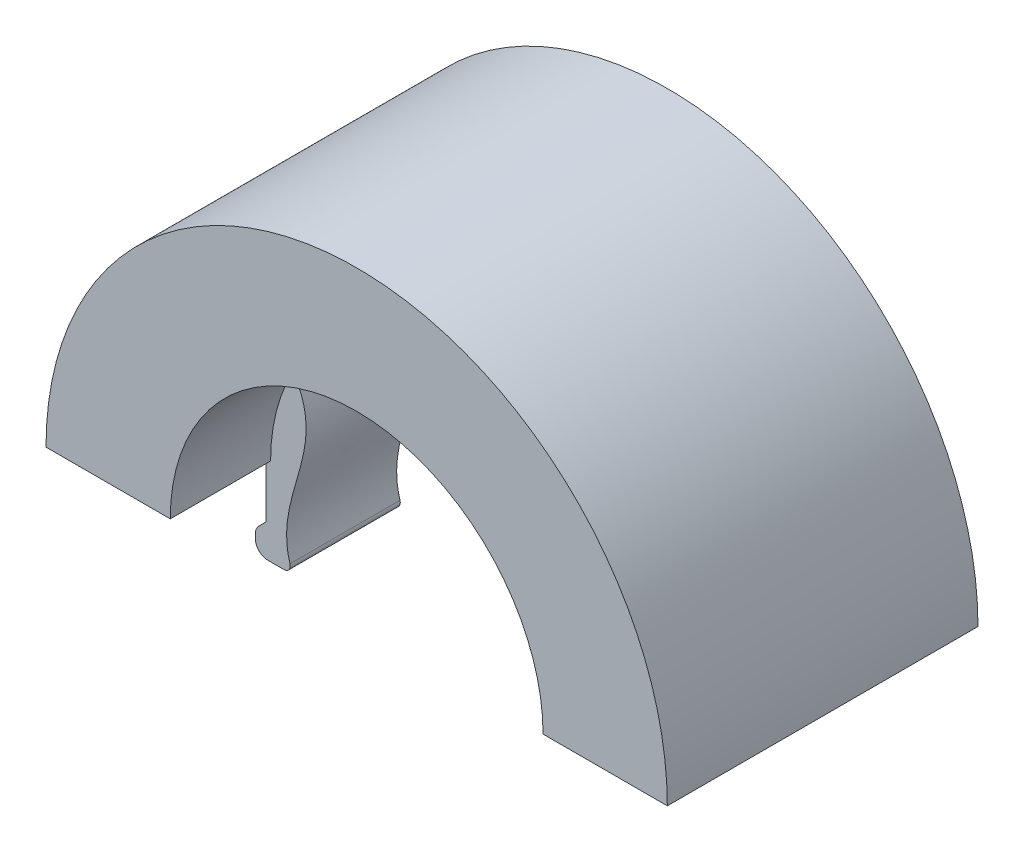
ISO-10303-21;
HEADER;
FILE_DESCRIPTION(('STEP AP214'),'2;1');
FILE_NAME('part.step','',(''),(''),'','','');
FILE_SCHEMA(('AUTOMOTIVE_DESIGN { 1 0 10303 214 1 1 1 1 }'));
ENDSEC;
DATA;
#1=APPLICATION_CONTEXT('core data for automotive mechanical design processes');
#2=APPLICATION_PROTOCOL_DEFINITION('international standard','automotive_design',2000,#1);
#3=PRODUCT_CONTEXT('',#1,'mechanical');
#4=PRODUCT('Part','Part','',(#3));
#5=PRODUCT_RELATED_PRODUCT_CATEGORY('part','',(#4));
#6=PRODUCT_DEFINITION_FORMATION('','',#4);
#7=PRODUCT_DEFINITION_CONTEXT('part definition',#1,'design');
#8=PRODUCT_DEFINITION('design','',#6,#7);
#9=PRODUCT_DEFINITION_SHAPE('','',#8);
#10=(LENGTH_UNIT() NAMED_UNIT(*) SI_UNIT(.MILLI.,.METRE.));
#11=(NAMED_UNIT(*) PLANE_ANGLE_UNIT() SI_UNIT($,.RADIAN.));
#12=(NAMED_UNIT(*) SI_UNIT($,.STERADIAN.) SOLID_ANGLE_UNIT());
#13=UNCERTAINTY_MEASURE_WITH_UNIT(LENGTH_MEASURE(1.E-05),#10,'distance_accuracy_value','');
#14=(GEOMETRIC_REPRESENTATION_CONTEXT(3) GLOBAL_UNCERTAINTY_ASSIGNED_CONTEXT((#13)) GLOBAL_UNIT_ASSIGNED_CONTEXT((#10,
#11,#12)) REPRESENTATION_CONTEXT('',''));
#15=CARTESIAN_POINT('',(0.,0.,0.));
#16=DIRECTION('',(0.,0.,1.));
#17=DIRECTION('',(1.,0.,0.));
#18=AXIS2_PLACEMENT_3D('',#15,#16,#17);
#19=CARTESIAN_POINT('',(0.,0.,12.5));
#20=DIRECTION('',(0.,0.,-1.));
#21=DIRECTION('',(-1.,0.,0.));
#22=AXIS2_PLACEMENT_3D('',#19,#20,#21);
#23=CYLINDRICAL_SURFACE('',#22,15.);
#24=DIRECTION('',(0.,0.,-1.));
#25=VECTOR('',#24,1.);
#26=CARTESIAN_POINT('',(-15.,0.,12.5));
#27=LINE('',#26,#25);
#28=CARTESIAN_POINT('',(-15.,0.,12.5));
#29=VERTEX_POINT('',#28);
#30=CARTESIAN_POINT('',(-15.,0.,4.42775));
#31=VERTEX_POINT('',#30);
#32=EDGE_CURVE('E226',#29,#31,#27,.T.);
#33=ORIENTED_EDGE('',*,*,#32,.T.);
#34=CARTESIAN_POINT('',(0.,0.,4.42775));
#35=DIRECTION('',(0.,0.,-1.));
#36=DIRECTION('',(-1.,0.,0.));
#37=AXIS2_PLACEMENT_3D('',#34,#35,#36);
#38=CIRCLE('',#37,15.);
#39=CARTESIAN_POINT('',(-13.2022,7.12052773044246,4.42775));
#40=VERTEX_POINT('',#39);
#41=EDGE_CURVE('E217',#31,#40,#38,.T.);
#42=ORIENTED_EDGE('',*,*,#41,.T.);
#43=DIRECTION('',(0.,0.,-1.));
#44=VECTOR('',#43,1.);
#45=CARTESIAN_POINT('',(-13.2022,7.12052773044246,4.42775));
#46=LINE('',#45,#44);
#47=CARTESIAN_POINT('',(-13.2022,7.12052773044246,-4.42775));
#48=VERTEX_POINT('',#47);
#49=EDGE_CURVE('E198',#40,#48,#46,.T.);
#50=ORIENTED_EDGE('',*,*,#49,.T.);
#51=CARTESIAN_POINT('',(0.,0.,-4.42775));
#52=DIRECTION('',(0.,0.,-1.));
#53=DIRECTION('',(-1.,0.,0.));
#54=AXIS2_PLACEMENT_3D('',#51,#52,#53);
#55=CIRCLE('',#54,15.);
#56=CARTESIAN_POINT('',(-15.,0.,-4.42775));
#57=VERTEX_POINT('',#56);
#58=EDGE_CURVE('E249',#57,#48,#55,.T.);
#59=ORIENTED_EDGE('',*,*,#58,.F.);
#60=CARTESIAN_POINT('',(-15.,0.,-12.5));
#61=VERTEX_POINT('',#60);
#62=EDGE_CURVE('E398',#57,#61,#27,.T.);
#63=ORIENTED_EDGE('',*,*,#62,.T.);
#64=CARTESIAN_POINT('',(0.,0.,-12.5));
#65=DIRECTION('',(0.,0.,1.));
#66=DIRECTION('',(1.,0.,0.));
#67=AXIS2_PLACEMENT_3D('',#64,#65,#66);
#68=CIRCLE('',#67,15.);
#69=CARTESIAN_POINT('',(15.,0.,-12.5));
#70=VERTEX_POINT('',#69);
#71=EDGE_CURVE('E403',#70,#61,#68,.T.);
#72=ORIENTED_EDGE('',*,*,#71,.F.);
#73=DIRECTION('',(0.,0.,-1.));
#74=VECTOR('',#73,1.);
#75=CARTESIAN_POINT('',(15.,0.,12.5));
#76=LINE('',#75,#74);
#77=CARTESIAN_POINT('',(15.,0.,-4.42775));
#78=VERTEX_POINT('',#77);
#79=EDGE_CURVE('E402',#78,#70,#76,.T.);
#80=ORIENTED_EDGE('',*,*,#79,.F.);
#81=CARTESIAN_POINT('',(0.,0.,-4.42775));
#82=DIRECTION('',(0.,0.,1.));
#83=DIRECTION('',(1.,0.,0.));
#84=AXIS2_PLACEMENT_3D('',#81,#82,#83);
#85=CIRCLE('',#84,15.);
#86=CARTESIAN_POINT('',(13.2022,7.12052773044246,-4.42775));
#87=VERTEX_POINT('',#86);
#88=EDGE_CURVE('E276',#78,#87,#85,.T.);
#89=ORIENTED_EDGE('',*,*,#88,.T.);
#90=DIRECTION('',(0.,0.,-1.));
#91=VECTOR('',#90,1.);
#92=CARTESIAN_POINT('',(13.2022,7.12052773044246,4.42775));
#93=LINE('',#92,#91);
#94=CARTESIAN_POINT('',(13.2022,7.12052773044246,4.42775));
#95=VERTEX_POINT('',#94);
#96=EDGE_CURVE('E428',#95,#87,#93,.T.);
#97=ORIENTED_EDGE('',*,*,#96,.F.);
#98=CARTESIAN_POINT('',(0.,0.,4.42775));
#99=DIRECTION('',(0.,0.,1.));
#100=DIRECTION('',(1.,0.,0.));
#101=AXIS2_PLACEMENT_3D('',#98,#99,#100);
#102=CIRCLE('',#101,15.);
#103=CARTESIAN_POINT('',(15.,0.,4.42775));
#104=VERTEX_POINT('',#103);
#105=EDGE_CURVE('E431',#104,#95,#102,.T.);
#106=ORIENTED_EDGE('',*,*,#105,.F.);
#107=CARTESIAN_POINT('',(15.,0.,12.5));
#108=VERTEX_POINT('',#107);
#109=EDGE_CURVE('E399',#108,#104,#76,.T.);
#110=ORIENTED_EDGE('',*,*,#109,.F.);
#111=CARTESIAN_POINT('',(0.,0.,12.5));
#112=DIRECTION('',(0.,0.,1.));
#113=DIRECTION('',(1.,0.,0.));
#114=AXIS2_PLACEMENT_3D('',#111,#112,#113);
#115=CIRCLE('',#114,15.);
#116=EDGE_CURVE('E416',#108,#29,#115,.T.);
#117=ORIENTED_EDGE('',*,*,#116,.T.);
#118=EDGE_LOOP('',(#33,#42,#50,#59,#63,#72,#80,#89,#97,#106,#110,#117));
#119=FACE_BOUND('',#118,.T.);
#120=ADVANCED_FACE('F37',(#119),#23,.F.);
#121=CARTESIAN_POINT('',(-25.,0.,12.5));
#122=DIRECTION('',(0.,1.,0.));
#123=DIRECTION('',(-1.,0.,0.));
#124=AXIS2_PLACEMENT_3D('',#121,#122,#123);
#125=PLANE('',#124);
#126=CARTESIAN_POINT('',(-20.,0.,-4.5));
#127=DIRECTION('',(0.,1.,0.));
#128=DIRECTION('',(-1.,0.,0.));
#129=AXIS2_PLACEMENT_3D('',#126,#127,#128);
#130=CIRCLE('',#129,3.388);
#131=CARTESIAN_POINT('',(-23.388,0.,-4.5));
#132=VERTEX_POINT('',#131);
#133=EDGE_CURVE('E773',#132,#132,#130,.T.);
#134=ORIENTED_EDGE('',*,*,#133,.T.);
#135=EDGE_LOOP('',(#134));
#136=FACE_BOUND('',#135,.T.);
#137=CARTESIAN_POINT('',(-20.,0.,4.5));
#138=DIRECTION('',(0.,1.,0.));
#139=DIRECTION('',(1.,0.,0.));
#140=AXIS2_PLACEMENT_3D('',#137,#138,#139);
#141=CIRCLE('',#140,3.388);
#142=CARTESIAN_POINT('',(-16.612,0.,4.5));
#143=VERTEX_POINT('',#142);
#144=EDGE_CURVE('E779',#143,#143,#141,.T.);
#145=ORIENTED_EDGE('',*,*,#144,.T.);
#146=EDGE_LOOP('',(#145));
#147=FACE_BOUND('',#146,.T.);
#148=DIRECTION('',(1.,0.,0.));
#149=VECTOR('',#148,1.);
#150=CARTESIAN_POINT('',(-15.3827,0.,4.42775));
#151=LINE('',#150,#149);
#152=CARTESIAN_POINT('',(-15.3827,0.,4.42775));
#153=VERTEX_POINT('',#152);
#154=EDGE_CURVE('E227',#153,#31,#151,.T.);
#155=ORIENTED_EDGE('',*,*,#154,.T.);
#156=ORIENTED_EDGE('',*,*,#32,.F.);
#157=DIRECTION('',(1.,0.,0.));
#158=VECTOR('',#157,1.);
#159=CARTESIAN_POINT('',(-25.,0.,12.5));
#160=LINE('',#159,#158);
#161=CARTESIAN_POINT('',(-25.,0.,12.5));
#162=VERTEX_POINT('',#161);
#163=EDGE_CURVE('E418',#162,#29,#160,.T.);
#164=ORIENTED_EDGE('',*,*,#163,.F.);
#165=DIRECTION('',(0.,0.,-1.));
#166=VECTOR('',#165,1.);
#167=CARTESIAN_POINT('',(-25.,0.,12.5));
#168=LINE('',#167,#166);
#169=CARTESIAN_POINT('',(-25.,0.,-12.5));
#170=VERTEX_POINT('',#169);
#171=EDGE_CURVE('E394',#162,#170,#168,.T.);
#172=ORIENTED_EDGE('',*,*,#171,.T.);
#173=DIRECTION('',(1.,0.,0.));
#174=VECTOR('',#173,1.);
#175=CARTESIAN_POINT('',(-25.,0.,-12.5));
#176=LINE('',#175,#174);
#177=EDGE_CURVE('E407',#170,#61,#176,.T.);
#178=ORIENTED_EDGE('',*,*,#177,.T.);
#179=ORIENTED_EDGE('',*,*,#62,.F.);
#180=DIRECTION('',(1.,0.,0.));
#181=VECTOR('',#180,1.);
#182=CARTESIAN_POINT('',(-15.3827,0.,-4.42775));
#183=LINE('',#182,#181);
#184=CARTESIAN_POINT('',(-15.3827,0.,-4.42775));
#185=VERTEX_POINT('',#184);
#186=EDGE_CURVE('E255',#185,#57,#183,.T.);
#187=ORIENTED_EDGE('',*,*,#186,.F.);
#188=DIRECTION('',(0.,0.,-1.));
#189=VECTOR('',#188,1.);
#190=CARTESIAN_POINT('',(-15.3827,0.,4.42775));
#191=LINE('',#190,#189);
#192=EDGE_CURVE('E211',#153,#185,#191,.T.);
#193=ORIENTED_EDGE('',*,*,#192,.F.);
#194=EDGE_LOOP('',(#155,#156,#164,#172,#178,#179,#187,#193));
#195=FACE_BOUND('',#194,.T.);
#196=ADVANCED_FACE('F299',(#136,#147,#195),#125,.F.);
#197=CARTESIAN_POINT('',(15.,0.,12.5));
#198=DIRECTION('',(0.,1.,0.));
#199=DIRECTION('',(-1.,0.,0.));
#200=AXIS2_PLACEMENT_3D('',#197,#198,#199);
#201=PLANE('',#200);
#202=CARTESIAN_POINT('',(20.,0.,-4.5));
#203=DIRECTION('',(0.,-1.,0.));
#204=DIRECTION('',(1.,0.,0.));
#205=AXIS2_PLACEMENT_3D('',#202,#203,#204);
#206=CIRCLE('',#205,3.388);
#207=CARTESIAN_POINT('',(23.388,0.,-4.5));
#208=VERTEX_POINT('',#207);
#209=EDGE_CURVE('E786',#208,#208,#206,.T.);
#210=ORIENTED_EDGE('',*,*,#209,.F.);
#211=EDGE_LOOP('',(#210));
#212=FACE_BOUND('',#211,.T.);
#213=CARTESIAN_POINT('',(20.,0.,4.5));
#214=DIRECTION('',(0.,-1.,0.));
#215=DIRECTION('',(-1.,0.,0.));
#216=AXIS2_PLACEMENT_3D('',#213,#214,#215);
#217=CIRCLE('',#216,3.388);
#218=CARTESIAN_POINT('',(16.612,0.,4.5));
#219=VERTEX_POINT('',#218);
#220=EDGE_CURVE('E776',#219,#219,#217,.T.);
#221=ORIENTED_EDGE('',*,*,#220,.F.);
#222=EDGE_LOOP('',(#221));
#223=FACE_BOUND('',#222,.T.);
#224=DIRECTION('',(-1.,0.,0.));
#225=VECTOR('',#224,1.);
#226=CARTESIAN_POINT('',(15.3827,0.,4.42775));
#227=LINE('',#226,#225);
#228=CARTESIAN_POINT('',(15.3827,0.,4.42775));
#229=VERTEX_POINT('',#228);
#230=EDGE_CURVE('E454',#229,#104,#227,.T.);
#231=ORIENTED_EDGE('',*,*,#230,.F.);
#232=DIRECTION('',(0.,0.,-1.));
#233=VECTOR('',#232,1.);
#234=CARTESIAN_POINT('',(15.3827,0.,4.42775));
#235=LINE('',#234,#233);
#236=CARTESIAN_POINT('',(15.3827,0.,-4.42775));
#237=VERTEX_POINT('',#236);
#238=EDGE_CURVE('E426',#229,#237,#235,.T.);
#239=ORIENTED_EDGE('',*,*,#238,.T.);
#240=DIRECTION('',(-1.,0.,0.));
#241=VECTOR('',#240,1.);
#242=CARTESIAN_POINT('',(15.3827,0.,-4.42775));
#243=LINE('',#242,#241);
#244=EDGE_CURVE('E433',#237,#78,#243,.T.);
#245=ORIENTED_EDGE('',*,*,#244,.T.);
#246=ORIENTED_EDGE('',*,*,#79,.T.);
#247=DIRECTION('',(1.,0.,0.));
#248=VECTOR('',#247,1.);
#249=CARTESIAN_POINT('',(15.,0.,-12.5));
#250=LINE('',#249,#248);
#251=CARTESIAN_POINT('',(25.,0.,-12.5));
#252=VERTEX_POINT('',#251);
#253=EDGE_CURVE('E412',#70,#252,#250,.T.);
#254=ORIENTED_EDGE('',*,*,#253,.T.);
#255=DIRECTION('',(0.,0.,-1.));
#256=VECTOR('',#255,1.);
#257=CARTESIAN_POINT('',(25.,0.,12.5));
#258=LINE('',#257,#256);
#259=CARTESIAN_POINT('',(25.,0.,12.5));
#260=VERTEX_POINT('',#259);
#261=EDGE_CURVE('E391',#260,#252,#258,.T.);
#262=ORIENTED_EDGE('',*,*,#261,.F.);
#263=DIRECTION('',(1.,0.,0.));
#264=VECTOR('',#263,1.);
#265=CARTESIAN_POINT('',(15.,0.,12.5));
#266=LINE('',#265,#264);
#267=EDGE_CURVE('E406',#108,#260,#266,.T.);
#268=ORIENTED_EDGE('',*,*,#267,.F.);
#269=ORIENTED_EDGE('',*,*,#109,.T.);
#270=EDGE_LOOP('',(#231,#239,#245,#246,#254,#262,#268,#269));
#271=FACE_BOUND('',#270,.T.);
#272=ADVANCED_FACE('F302',(#212,#223,#271),#201,.F.);
#273=CARTESIAN_POINT('',(0.,0.,12.5));
#274=DIRECTION('',(0.,0.,-1.));
#275=DIRECTION('',(-1.,0.,0.));
#276=AXIS2_PLACEMENT_3D('',#273,#274,#275);
#277=CYLINDRICAL_SURFACE('',#276,25.);
#278=CARTESIAN_POINT('',(0.,0.,-12.5));
#279=DIRECTION('',(0.,0.,1.));
#280=DIRECTION('',(1.,0.,0.));
#281=AXIS2_PLACEMENT_3D('',#278,#279,#280);
#282=CIRCLE('',#281,25.);
#283=EDGE_CURVE('E410',#252,#170,#282,.T.);
#284=ORIENTED_EDGE('',*,*,#283,.T.);
#285=ORIENTED_EDGE('',*,*,#171,.F.);
#286=CARTESIAN_POINT('',(0.,0.,12.5));
#287=DIRECTION('',(0.,0.,1.));
#288=DIRECTION('',(1.,0.,0.));
#289=AXIS2_PLACEMENT_3D('',#286,#287,#288);
#290=CIRCLE('',#289,25.);
#291=EDGE_CURVE('E420',#260,#162,#290,.T.);
#292=ORIENTED_EDGE('',*,*,#291,.F.);
#293=ORIENTED_EDGE('',*,*,#261,.T.);
#294=EDGE_LOOP('',(#284,#285,#292,#293));
#295=FACE_BOUND('',#294,.T.);
#296=ADVANCED_FACE('F292',(#295),#277,.T.);
#297=CARTESIAN_POINT('',(0.,0.,12.5));
#298=DIRECTION('',(0.,0.,1.));
#299=DIRECTION('',(1.,0.,0.));
#300=AXIS2_PLACEMENT_3D('',#297,#298,#299);
#301=PLANE('',#300);
#302=ORIENTED_EDGE('',*,*,#267,.T.);
#303=ORIENTED_EDGE('',*,*,#291,.T.);
#304=ORIENTED_EDGE('',*,*,#163,.T.);
#305=ORIENTED_EDGE('',*,*,#116,.F.);
#306=EDGE_LOOP('',(#302,#303,#304,#305));
#307=FACE_BOUND('',#306,.T.);
#308=ADVANCED_FACE('F289',(#307),#301,.T.);
#309=CARTESIAN_POINT('',(0.,0.,-12.5));
#310=DIRECTION('',(0.,0.,1.));
#311=DIRECTION('',(1.,0.,0.));
#312=AXIS2_PLACEMENT_3D('',#309,#310,#311);
#313=PLANE('',#312);
#314=ORIENTED_EDGE('',*,*,#253,.F.);
#315=ORIENTED_EDGE('',*,*,#71,.T.);
#316=ORIENTED_EDGE('',*,*,#177,.F.);
#317=ORIENTED_EDGE('',*,*,#283,.F.);
#318=EDGE_LOOP('',(#314,#315,#316,#317));
#319=FACE_BOUND('',#318,.T.);
#320=ADVANCED_FACE('F287',(#319),#313,.F.);
#321=CARTESIAN_POINT('',(13.2022,7.12052773044246,4.42775));
#322=CARTESIAN_POINT('',(9.98681990184567,2.44993192044761,4.42775));
#323=CARTESIAN_POINT('',(15.3099969340424,-2.18235211967049,4.42775));
#324=CARTESIAN_POINT('',(13.2022,-7.031,4.42775));
#325=B_SPLINE_CURVE_WITH_KNOTS('',3,(#321,#322,#323,#324),.UNSPECIFIED.,.F.,.F.,(4,4),(0.,1.),.UNSPECIFIED.);
#326=DIRECTION('',(0.,0.,-1.));
#327=VECTOR('',#326,1.);
#328=SURFACE_OF_LINEAR_EXTRUSION('',#325,#327);
#329=CARTESIAN_POINT('',(13.2022,7.12052773044246,-4.42775));
#330=CARTESIAN_POINT('',(9.98681990184567,2.44993192044761,-4.42775));
#331=CARTESIAN_POINT('',(15.3099969340424,-2.18235211967049,-4.42775));
#332=CARTESIAN_POINT('',(13.2022,-7.031,-4.42775));
#333=B_SPLINE_CURVE_WITH_KNOTS('',3,(#329,#330,#331,#332),.UNSPECIFIED.,.F.,.F.,(4,4),(0.,1.),.UNSPECIFIED.);
#334=CARTESIAN_POINT('',(13.4409323965601,-6.3847076068452,-4.42775));
#335=VERTEX_POINT('',#334);
#336=EDGE_CURVE('E210',#87,#335,#333,.T.);
#337=ORIENTED_EDGE('',*,*,#336,.T.);
#338=DIRECTION('',(0.,0.,-1.));
#339=VECTOR('',#338,1.);
#340=CARTESIAN_POINT('',(13.4409323965601,-6.3847076068452,-4.42775));
#341=LINE('',#340,#339);
#342=CARTESIAN_POINT('',(13.4409323965601,-6.3847076068452,4.42775));
#343=VERTEX_POINT('',#342);
#344=EDGE_CURVE('E45',#335,#343,#341,.F.);
#345=ORIENTED_EDGE('',*,*,#344,.T.);
#346=EDGE_CURVE('E270',#95,#343,#325,.T.);
#347=ORIENTED_EDGE('',*,*,#346,.F.);
#348=ORIENTED_EDGE('',*,*,#96,.T.);
#349=EDGE_LOOP('',(#337,#345,#347,#348));
#350=FACE_BOUND('',#349,.T.);
#351=ADVANCED_FACE('F282',(#350),#328,.F.);
#352=CARTESIAN_POINT('',(13.2022,-7.031,4.42775));
#353=DIRECTION('',(0.,1.,0.));
#354=DIRECTION('',(0.,0.,1.));
#355=AXIS2_PLACEMENT_3D('',#352,#353,#354);
#356=PLANE('',#355);
#357=DIRECTION('',(1.,0.,0.));
#358=VECTOR('',#357,1.);
#359=CARTESIAN_POINT('',(13.2022,-7.031,4.42775));
#360=LINE('',#359,#358);
#361=CARTESIAN_POINT('',(13.9190521887723,-7.031,4.42775));
#362=VERTEX_POINT('',#361);
#363=CARTESIAN_POINT('',(15.2282,-7.031,4.42775));
#364=VERTEX_POINT('',#363);
#365=EDGE_CURVE('E275',#362,#364,#360,.T.);
#366=ORIENTED_EDGE('',*,*,#365,.F.);
#367=DIRECTION('',(0.,0.,-1.));
#368=VECTOR('',#367,1.);
#369=CARTESIAN_POINT('',(13.9190521887723,-7.031,4.42775));
#370=LINE('',#369,#368);
#371=CARTESIAN_POINT('',(13.9190521887723,-7.031,-4.42775));
#372=VERTEX_POINT('',#371);
#373=EDGE_CURVE('E342',#362,#372,#370,.T.);
#374=ORIENTED_EDGE('',*,*,#373,.T.);
#375=DIRECTION('',(1.,0.,0.));
#376=VECTOR('',#375,1.);
#377=CARTESIAN_POINT('',(13.2022,-7.031,-4.42775));
#378=LINE('',#377,#376);
#379=CARTESIAN_POINT('',(15.2282,-7.031,-4.42775));
#380=VERTEX_POINT('',#379);
#381=EDGE_CURVE('E444',#372,#380,#378,.T.);
#382=ORIENTED_EDGE('',*,*,#381,.T.);
#383=DIRECTION('',(0.,0.,-1.));
#384=VECTOR('',#383,1.);
#385=CARTESIAN_POINT('',(15.2282,-7.031,4.42775));
#386=LINE('',#385,#384);
#387=EDGE_CURVE('E382',#380,#364,#386,.F.);
#388=ORIENTED_EDGE('',*,*,#387,.T.);
#389=EDGE_LOOP('',(#366,#374,#382,#388));
#390=FACE_BOUND('',#389,.T.);
#391=ADVANCED_FACE('F286',(#390),#356,.F.);
#392=CARTESIAN_POINT('',(16.2282,-7.031,4.42775));
#393=DIRECTION('',(-1.,0.,0.));
#394=DIRECTION('',(0.,0.,1.));
#395=AXIS2_PLACEMENT_3D('',#392,#393,#394);
#396=PLANE('',#395);
#397=DIRECTION('',(0.,1.,0.));
#398=VECTOR('',#397,1.);
#399=CARTESIAN_POINT('',(16.2282,-7.031,-4.42775));
#400=LINE('',#399,#398);
#401=CARTESIAN_POINT('',(16.2282,-6.031,-4.42775));
#402=VERTEX_POINT('',#401);
#403=CARTESIAN_POINT('',(16.2282,-5.7097135623731,-4.42775));
#404=VERTEX_POINT('',#403);
#405=EDGE_CURVE('E441',#402,#404,#400,.T.);
#406=ORIENTED_EDGE('',*,*,#405,.T.);
#407=DIRECTION('',(0.,0.,-1.));
#408=VECTOR('',#407,1.);
#409=CARTESIAN_POINT('',(16.2282,-5.7097135623731,4.42775));
#410=LINE('',#409,#408);
#411=CARTESIAN_POINT('',(16.2282,-5.7097135623731,4.42775));
#412=VERTEX_POINT('',#411);
#413=EDGE_CURVE('E363',#404,#412,#410,.F.);
#414=ORIENTED_EDGE('',*,*,#413,.T.);
#415=DIRECTION('',(0.,1.,0.));
#416=VECTOR('',#415,1.);
#417=CARTESIAN_POINT('',(16.2282,-7.031,4.42775));
#418=LINE('',#417,#416);
#419=CARTESIAN_POINT('',(16.2282,-6.031,4.42775));
#420=VERTEX_POINT('',#419);
#421=EDGE_CURVE('E461',#420,#412,#418,.T.);
#422=ORIENTED_EDGE('',*,*,#421,.F.);
#423=DIRECTION('',(0.,0.,-1.));
#424=VECTOR('',#423,1.);
#425=CARTESIAN_POINT('',(16.2282,-6.031,4.42775));
#426=LINE('',#425,#424);
#427=EDGE_CURVE('E388',#420,#402,#426,.T.);
#428=ORIENTED_EDGE('',*,*,#427,.T.);
#429=EDGE_LOOP('',(#406,#414,#422,#428));
#430=FACE_BOUND('',#429,.T.);
#431=ADVANCED_FACE('F476',(#430),#396,.F.);
#432=CARTESIAN_POINT('',(16.2282,-5.2955,4.42775));
#433=DIRECTION('',(-0.707106781186548,-0.707106781186547,0.));
#434=DIRECTION('',(0.707106781186547,-0.707106781186548,0.));
#435=AXIS2_PLACEMENT_3D('',#432,#433,#434);
#436=PLANE('',#435);
#437=DIRECTION('',(-0.707106781186547,0.707106781186548,0.));
#438=VECTOR('',#437,1.);
#439=CARTESIAN_POINT('',(16.2282,-5.2955,4.42775));
#440=LINE('',#439,#438);
#441=CARTESIAN_POINT('',(15.9353067811865,-5.00260678118655,4.42775));
#442=VERTEX_POINT('',#441);
#443=CARTESIAN_POINT('',(15.3827,-4.45,4.42775));
#444=VERTEX_POINT('',#443);
#445=EDGE_CURVE('E460',#442,#444,#440,.T.);
#446=ORIENTED_EDGE('',*,*,#445,.F.);
#447=DIRECTION('',(0.,0.,-1.));
#448=VECTOR('',#447,1.);
#449=CARTESIAN_POINT('',(15.9353067811865,-5.00260678118655,4.42775));
#450=LINE('',#449,#448);
#451=CARTESIAN_POINT('',(15.9353067811865,-5.00260678118655,-4.42775));
#452=VERTEX_POINT('',#451);
#453=EDGE_CURVE('E367',#442,#452,#450,.T.);
#454=ORIENTED_EDGE('',*,*,#453,.T.);
#455=DIRECTION('',(-0.707106781186547,0.707106781186548,0.));
#456=VECTOR('',#455,1.);
#457=CARTESIAN_POINT('',(16.2282,-5.2955,-4.42775));
#458=LINE('',#457,#456);
#459=CARTESIAN_POINT('',(15.3827,-4.45,-4.42775));
#460=VERTEX_POINT('',#459);
#461=EDGE_CURVE('E439',#452,#460,#458,.T.);
#462=ORIENTED_EDGE('',*,*,#461,.T.);
#463=DIRECTION('',(0.,0.,-1.));
#464=VECTOR('',#463,1.);
#465=CARTESIAN_POINT('',(15.3827,-4.45,4.42775));
#466=LINE('',#465,#464);
#467=EDGE_CURVE('E415',#444,#460,#466,.T.);
#468=ORIENTED_EDGE('',*,*,#467,.F.);
#469=EDGE_LOOP('',(#446,#454,#462,#468));
#470=FACE_BOUND('',#469,.T.);
#471=ADVANCED_FACE('F483',(#470),#436,.F.);
#472=CARTESIAN_POINT('',(15.3827,0.,4.42775));
#473=DIRECTION('',(1.,0.,0.));
#474=DIRECTION('',(0.,0.,-1.));
#475=AXIS2_PLACEMENT_3D('',#472,#473,#474);
#476=PLANE('',#475);
#477=DIRECTION('',(0.,-1.,0.));
#478=VECTOR('',#477,1.);
#479=CARTESIAN_POINT('',(15.3827,0.,-4.42775));
#480=LINE('',#479,#478);
#481=EDGE_CURVE('E436',#237,#460,#480,.T.);
#482=ORIENTED_EDGE('',*,*,#481,.F.);
#483=ORIENTED_EDGE('',*,*,#238,.F.);
#484=DIRECTION('',(0.,-1.,0.));
#485=VECTOR('',#484,1.);
#486=CARTESIAN_POINT('',(15.3827,0.,4.42775));
#487=LINE('',#486,#485);
#488=EDGE_CURVE('E457',#229,#444,#487,.T.);
#489=ORIENTED_EDGE('',*,*,#488,.T.);
#490=ORIENTED_EDGE('',*,*,#467,.T.);
#491=EDGE_LOOP('',(#482,#483,#489,#490));
#492=FACE_BOUND('',#491,.T.);
#493=ADVANCED_FACE('F489',(#492),#476,.T.);
#494=CARTESIAN_POINT('',(12.786856313458,0.111533391596729,4.42775));
#495=DIRECTION('',(0.,0.,-1.));
#496=DIRECTION('',(-1.,0.,0.));
#497=AXIS2_PLACEMENT_3D('',#494,#495,#496);
#498=PLANE('',#497);
#499=ORIENTED_EDGE('',*,*,#346,.T.);
#500=CARTESIAN_POINT('',(13.9190521887723,-6.531,4.42775));
#501=DIRECTION('',(0.,0.,-1.));
#502=DIRECTION('',(-1.,0.,0.));
#503=AXIS2_PLACEMENT_3D('',#500,#501,#502);
#504=CIRCLE('',#503,0.5);
#505=EDGE_CURVE('E11',#343,#362,#504,.F.);
#506=ORIENTED_EDGE('',*,*,#505,.T.);
#507=ORIENTED_EDGE('',*,*,#365,.T.);
#508=CARTESIAN_POINT('',(15.2282,-6.031,4.42775));
#509=DIRECTION('',(0.,0.,-1.));
#510=DIRECTION('',(-1.,0.,0.));
#511=AXIS2_PLACEMENT_3D('',#508,#509,#510);
#512=CIRCLE('',#511,1.);
#513=EDGE_CURVE('E380',#364,#420,#512,.F.);
#514=ORIENTED_EDGE('',*,*,#513,.T.);
#515=ORIENTED_EDGE('',*,*,#421,.T.);
#516=CARTESIAN_POINT('',(15.2282,-5.7097135623731,4.42775));
#517=DIRECTION('',(0.,0.,-1.));
#518=DIRECTION('',(-1.,0.,0.));
#519=AXIS2_PLACEMENT_3D('',#516,#517,#518);
#520=CIRCLE('',#519,1.);
#521=EDGE_CURVE('E361',#412,#442,#520,.F.);
#522=ORIENTED_EDGE('',*,*,#521,.T.);
#523=ORIENTED_EDGE('',*,*,#445,.T.);
#524=ORIENTED_EDGE('',*,*,#488,.F.);
#525=ORIENTED_EDGE('',*,*,#230,.T.);
#526=ORIENTED_EDGE('',*,*,#105,.T.);
#527=EDGE_LOOP('',(#499,#506,#507,#514,#515,#522,#523,#524,#525,#526));
#528=FACE_BOUND('',#527,.T.);
#529=ADVANCED_FACE('F467',(#528),#498,.F.);
#530=CARTESIAN_POINT('',(12.786856313458,0.111533391596729,-4.42775));
#531=DIRECTION('',(0.,0.,-1.));
#532=DIRECTION('',(-1.,0.,0.));
#533=AXIS2_PLACEMENT_3D('',#530,#531,#532);
#534=PLANE('',#533);
#535=ORIENTED_EDGE('',*,*,#381,.F.);
#536=CARTESIAN_POINT('',(13.9190521887723,-6.531,-4.42775));
#537=DIRECTION('',(0.,0.,-1.));
#538=DIRECTION('',(-1.,0.,0.));
#539=AXIS2_PLACEMENT_3D('',#536,#537,#538);
#540=CIRCLE('',#539,0.5);
#541=EDGE_CURVE('E59',#372,#335,#540,.T.);
#542=ORIENTED_EDGE('',*,*,#541,.T.);
#543=ORIENTED_EDGE('',*,*,#336,.F.);
#544=ORIENTED_EDGE('',*,*,#88,.F.);
#545=ORIENTED_EDGE('',*,*,#244,.F.);
#546=ORIENTED_EDGE('',*,*,#481,.T.);
#547=ORIENTED_EDGE('',*,*,#461,.F.);
#548=CARTESIAN_POINT('',(15.2282,-5.7097135623731,-4.42775));
#549=DIRECTION('',(0.,0.,-1.));
#550=DIRECTION('',(-1.,0.,0.));
#551=AXIS2_PLACEMENT_3D('',#548,#549,#550);
#552=CIRCLE('',#551,1.);
#553=EDGE_CURVE('E365',#452,#404,#552,.T.);
#554=ORIENTED_EDGE('',*,*,#553,.T.);
#555=ORIENTED_EDGE('',*,*,#405,.F.);
#556=CARTESIAN_POINT('',(15.2282,-6.031,-4.42775));
#557=DIRECTION('',(0.,0.,-1.));
#558=DIRECTION('',(-1.,0.,0.));
#559=AXIS2_PLACEMENT_3D('',#556,#557,#558);
#560=CIRCLE('',#559,1.);
#561=EDGE_CURVE('E385',#402,#380,#560,.T.);
#562=ORIENTED_EDGE('',*,*,#561,.T.);
#563=EDGE_LOOP('',(#535,#542,#543,#544,#545,#546,#547,#554,#555,#562));
#564=FACE_BOUND('',#563,.T.);
#565=ADVANCED_FACE('F478',(#564),#534,.T.);
#566=CARTESIAN_POINT('',(-13.2022,7.12052773044246,4.42775));
#567=CARTESIAN_POINT('',(-9.98681990184567,2.44993192044761,4.42775));
#568=CARTESIAN_POINT('',(-15.3099969340424,-2.18235211967049,4.42775));
#569=CARTESIAN_POINT('',(-13.2022,-7.031,4.42775));
#570=B_SPLINE_CURVE_WITH_KNOTS('',3,(#566,#567,#568,#569),.UNSPECIFIED.,.F.,.F.,(4,4),(0.,1.),.UNSPECIFIED.);
#571=DIRECTION('',(0.,0.,-1.));
#572=VECTOR('',#571,1.);
#573=SURFACE_OF_LINEAR_EXTRUSION('',#570,#572);
#574=CARTESIAN_POINT('',(-13.4409323965601,-6.3847076068452,4.42775));
#575=VERTEX_POINT('',#574);
#576=EDGE_CURVE('E202',#40,#575,#570,.T.);
#577=ORIENTED_EDGE('',*,*,#576,.T.);
#578=DIRECTION('',(0.,0.,-1.));
#579=VECTOR('',#578,1.);
#580=CARTESIAN_POINT('',(-13.4409323965601,-6.3847076068452,4.42775));
#581=LINE('',#580,#579);
#582=CARTESIAN_POINT('',(-13.4409323965601,-6.3847076068452,-4.42775));
#583=VERTEX_POINT('',#582);
#584=EDGE_CURVE('E341',#575,#583,#581,.T.);
#585=ORIENTED_EDGE('',*,*,#584,.T.);
#586=CARTESIAN_POINT('',(-13.2022,7.12052773044246,-4.42775));
#587=CARTESIAN_POINT('',(-9.98681990184567,2.44993192044761,-4.42775));
#588=CARTESIAN_POINT('',(-15.3099969340424,-2.18235211967049,-4.42775));
#589=CARTESIAN_POINT('',(-13.2022,-7.031,-4.42775));
#590=B_SPLINE_CURVE_WITH_KNOTS('',3,(#586,#587,#588,#589),.UNSPECIFIED.,.F.,.F.,(4,4),(0.,1.),.UNSPECIFIED.);
#591=EDGE_CURVE('E205',#48,#583,#590,.T.);
#592=ORIENTED_EDGE('',*,*,#591,.F.);
#593=ORIENTED_EDGE('',*,*,#49,.F.);
#594=EDGE_LOOP('',(#577,#585,#592,#593));
#595=FACE_BOUND('',#594,.T.);
#596=ADVANCED_FACE('F200',(#595),#573,.T.);
#597=CARTESIAN_POINT('',(-15.3827,0.,4.42775));
#598=DIRECTION('',(1.,0.,0.));
#599=DIRECTION('',(0.,0.,-1.));
#600=AXIS2_PLACEMENT_3D('',#597,#598,#599);
#601=PLANE('',#600);
#602=DIRECTION('',(0.,-1.,0.));
#603=VECTOR('',#602,1.);
#604=CARTESIAN_POINT('',(-15.3827,0.,-4.42775));
#605=LINE('',#604,#603);
#606=CARTESIAN_POINT('',(-15.3827,-4.45,-4.42775));
#607=VERTEX_POINT('',#606);
#608=EDGE_CURVE('E257',#185,#607,#605,.T.);
#609=ORIENTED_EDGE('',*,*,#608,.T.);
#610=DIRECTION('',(0.,0.,-1.));
#611=VECTOR('',#610,1.);
#612=CARTESIAN_POINT('',(-15.3827,-4.45,4.42775));
#613=LINE('',#612,#611);
#614=CARTESIAN_POINT('',(-15.3827,-4.45,4.42775));
#615=VERTEX_POINT('',#614);
#616=EDGE_CURVE('E245',#615,#607,#613,.T.);
#617=ORIENTED_EDGE('',*,*,#616,.F.);
#618=DIRECTION('',(0.,-1.,0.));
#619=VECTOR('',#618,1.);
#620=CARTESIAN_POINT('',(-15.3827,0.,4.42775));
#621=LINE('',#620,#619);
#622=EDGE_CURVE('E229',#153,#615,#621,.T.);
#623=ORIENTED_EDGE('',*,*,#622,.F.);
#624=ORIENTED_EDGE('',*,*,#192,.T.);
#625=EDGE_LOOP('',(#609,#617,#623,#624));
#626=FACE_BOUND('',#625,.T.);
#627=ADVANCED_FACE('F506',(#626),#601,.F.);
#628=CARTESIAN_POINT('',(-16.2282,-5.2955,4.42775));
#629=DIRECTION('',(-0.707106781186548,0.707106781186547,0.));
#630=DIRECTION('',(-0.707106781186547,-0.707106781186548,0.));
#631=AXIS2_PLACEMENT_3D('',#628,#629,#630);
#632=PLANE('',#631);
#633=DIRECTION('',(0.707106781186547,0.707106781186548,0.));
#634=VECTOR('',#633,1.);
#635=CARTESIAN_POINT('',(-16.2282,-5.2955,-4.42775));
#636=LINE('',#635,#634);
#637=CARTESIAN_POINT('',(-15.9353067811865,-5.00260678118655,-4.42775));
#638=VERTEX_POINT('',#637);
#639=EDGE_CURVE('E260',#638,#607,#636,.T.);
#640=ORIENTED_EDGE('',*,*,#639,.F.);
#641=DIRECTION('',(0.,0.,-1.));
#642=VECTOR('',#641,1.);
#643=CARTESIAN_POINT('',(-15.9353067811865,-5.00260678118655,4.42775));
#644=LINE('',#643,#642);
#645=CARTESIAN_POINT('',(-15.9353067811865,-5.00260678118655,4.42775));
#646=VERTEX_POINT('',#645);
#647=EDGE_CURVE('E354',#638,#646,#644,.F.);
#648=ORIENTED_EDGE('',*,*,#647,.T.);
#649=DIRECTION('',(0.707106781186547,0.707106781186548,0.));
#650=VECTOR('',#649,1.);
#651=CARTESIAN_POINT('',(-16.2282,-5.2955,4.42775));
#652=LINE('',#651,#650);
#653=EDGE_CURVE('E238',#646,#615,#652,.T.);
#654=ORIENTED_EDGE('',*,*,#653,.T.);
#655=ORIENTED_EDGE('',*,*,#616,.T.);
#656=EDGE_LOOP('',(#640,#648,#654,#655));
#657=FACE_BOUND('',#656,.T.);
#658=ADVANCED_FACE('F509',(#657),#632,.T.);
#659=CARTESIAN_POINT('',(-16.2282,-7.031,4.42775));
#660=DIRECTION('',(-1.,0.,0.));
#661=DIRECTION('',(0.,0.,1.));
#662=AXIS2_PLACEMENT_3D('',#659,#660,#661);
#663=PLANE('',#662);
#664=DIRECTION('',(0.,1.,0.));
#665=VECTOR('',#664,1.);
#666=CARTESIAN_POINT('',(-16.2282,-7.031,4.42775));
#667=LINE('',#666,#665);
#668=CARTESIAN_POINT('',(-16.2282,-6.031,4.42775));
#669=VERTEX_POINT('',#668);
#670=CARTESIAN_POINT('',(-16.2282,-5.7097135623731,4.42775));
#671=VERTEX_POINT('',#670);
#672=EDGE_CURVE('E240',#669,#671,#667,.T.);
#673=ORIENTED_EDGE('',*,*,#672,.T.);
#674=DIRECTION('',(0.,0.,-1.));
#675=VECTOR('',#674,1.);
#676=CARTESIAN_POINT('',(-16.2282,-5.7097135623731,4.42775));
#677=LINE('',#676,#675);
#678=CARTESIAN_POINT('',(-16.2282,-5.7097135623731,-4.42775));
#679=VERTEX_POINT('',#678);
#680=EDGE_CURVE('E358',#671,#679,#677,.T.);
#681=ORIENTED_EDGE('',*,*,#680,.T.);
#682=DIRECTION('',(0.,1.,0.));
#683=VECTOR('',#682,1.);
#684=CARTESIAN_POINT('',(-16.2282,-7.031,-4.42775));
#685=LINE('',#684,#683);
#686=CARTESIAN_POINT('',(-16.2282,-6.031,-4.42775));
#687=VERTEX_POINT('',#686);
#688=EDGE_CURVE('E262',#687,#679,#685,.T.);
#689=ORIENTED_EDGE('',*,*,#688,.F.);
#690=DIRECTION('',(0.,0.,-1.));
#691=VECTOR('',#690,1.);
#692=CARTESIAN_POINT('',(-16.2282,-6.031,4.42775));
#693=LINE('',#692,#691);
#694=EDGE_CURVE('E373',#687,#669,#693,.F.);
#695=ORIENTED_EDGE('',*,*,#694,.T.);
#696=EDGE_LOOP('',(#673,#681,#689,#695));
#697=FACE_BOUND('',#696,.T.);
#698=ADVANCED_FACE('F515',(#697),#663,.T.);
#699=CARTESIAN_POINT('',(-13.2022,-7.031,4.42775));
#700=DIRECTION('',(0.,-1.,0.));
#701=DIRECTION('',(0.,0.,-1.));
#702=AXIS2_PLACEMENT_3D('',#699,#700,#701);
#703=PLANE('',#702);
#704=DIRECTION('',(-1.,0.,0.));
#705=VECTOR('',#704,1.);
#706=CARTESIAN_POINT('',(-13.2022,-7.031,-4.42775));
#707=LINE('',#706,#705);
#708=CARTESIAN_POINT('',(-13.9190521887723,-7.031,-4.42775));
#709=VERTEX_POINT('',#708);
#710=CARTESIAN_POINT('',(-15.2282,-7.031,-4.42775));
#711=VERTEX_POINT('',#710);
#712=EDGE_CURVE('E221',#709,#711,#707,.T.);
#713=ORIENTED_EDGE('',*,*,#712,.F.);
#714=DIRECTION('',(0.,0.,-1.));
#715=VECTOR('',#714,1.);
#716=CARTESIAN_POINT('',(-13.9190521887723,-7.031,4.42775));
#717=LINE('',#716,#715);
#718=CARTESIAN_POINT('',(-13.9190521887723,-7.031,4.42775));
#719=VERTEX_POINT('',#718);
#720=EDGE_CURVE('E340',#709,#719,#717,.F.);
#721=ORIENTED_EDGE('',*,*,#720,.T.);
#722=DIRECTION('',(-1.,0.,0.));
#723=VECTOR('',#722,1.);
#724=CARTESIAN_POINT('',(-13.2022,-7.031,4.42775));
#725=LINE('',#724,#723);
#726=CARTESIAN_POINT('',(-15.2282,-7.031,4.42775));
#727=VERTEX_POINT('',#726);
#728=EDGE_CURVE('E243',#719,#727,#725,.T.);
#729=ORIENTED_EDGE('',*,*,#728,.T.);
#730=DIRECTION('',(0.,0.,-1.));
#731=VECTOR('',#730,1.);
#732=CARTESIAN_POINT('',(-15.2282,-7.031,4.42775));
#733=LINE('',#732,#731);
#734=EDGE_CURVE('E377',#727,#711,#733,.T.);
#735=ORIENTED_EDGE('',*,*,#734,.T.);
#736=EDGE_LOOP('',(#713,#721,#729,#735));
#737=FACE_BOUND('',#736,.T.);
#738=ADVANCED_FACE('F522',(#737),#703,.T.);
#739=CARTESIAN_POINT('',(-12.786856313458,0.111533391596729,4.42775));
#740=DIRECTION('',(0.,0.,-1.));
#741=DIRECTION('',(1.,0.,0.));
#742=AXIS2_PLACEMENT_3D('',#739,#740,#741);
#743=PLANE('',#742);
#744=ORIENTED_EDGE('',*,*,#728,.F.);
#745=CARTESIAN_POINT('',(-13.9190521887723,-6.531,4.42775));
#746=DIRECTION('',(0.,0.,-1.));
#747=DIRECTION('',(-1.,0.,0.));
#748=AXIS2_PLACEMENT_3D('',#745,#746,#747);
#749=CIRCLE('',#748,0.5);
#750=EDGE_CURVE('E220',#719,#575,#749,.F.);
#751=ORIENTED_EDGE('',*,*,#750,.T.);
#752=ORIENTED_EDGE('',*,*,#576,.F.);
#753=ORIENTED_EDGE('',*,*,#41,.F.);
#754=ORIENTED_EDGE('',*,*,#154,.F.);
#755=ORIENTED_EDGE('',*,*,#622,.T.);
#756=ORIENTED_EDGE('',*,*,#653,.F.);
#757=CARTESIAN_POINT('',(-15.2282,-5.7097135623731,4.42775));
#758=DIRECTION('',(0.,0.,-1.));
#759=DIRECTION('',(-1.,0.,0.));
#760=AXIS2_PLACEMENT_3D('',#757,#758,#759);
#761=CIRCLE('',#760,1.);
#762=EDGE_CURVE('E352',#646,#671,#761,.F.);
#763=ORIENTED_EDGE('',*,*,#762,.T.);
#764=ORIENTED_EDGE('',*,*,#672,.F.);
#765=CARTESIAN_POINT('',(-15.2282,-6.031,4.42775));
#766=DIRECTION('',(0.,0.,-1.));
#767=DIRECTION('',(-1.,0.,0.));
#768=AXIS2_PLACEMENT_3D('',#765,#766,#767);
#769=CIRCLE('',#768,1.);
#770=EDGE_CURVE('E370',#669,#727,#769,.F.);
#771=ORIENTED_EDGE('',*,*,#770,.T.);
#772=EDGE_LOOP('',(#744,#751,#752,#753,#754,#755,#756,#763,#764,#771));
#773=FACE_BOUND('',#772,.T.);
#774=ADVANCED_FACE('F215',(#773),#743,.F.);
#775=CARTESIAN_POINT('',(-12.786856313458,0.111533391596729,-4.42775));
#776=DIRECTION('',(0.,0.,-1.));
#777=DIRECTION('',(1.,0.,0.));
#778=AXIS2_PLACEMENT_3D('',#775,#776,#777);
#779=PLANE('',#778);
#780=ORIENTED_EDGE('',*,*,#591,.T.);
#781=CARTESIAN_POINT('',(-13.9190521887723,-6.531,-4.42775));
#782=DIRECTION('',(0.,0.,-1.));
#783=DIRECTION('',(-1.,0.,0.));
#784=AXIS2_PLACEMENT_3D('',#781,#782,#783);
#785=CIRCLE('',#784,0.5);
#786=EDGE_CURVE('E346',#583,#709,#785,.T.);
#787=ORIENTED_EDGE('',*,*,#786,.T.);
#788=ORIENTED_EDGE('',*,*,#712,.T.);
#789=CARTESIAN_POINT('',(-15.2282,-6.031,-4.42775));
#790=DIRECTION('',(0.,0.,-1.));
#791=DIRECTION('',(-1.,0.,0.));
#792=AXIS2_PLACEMENT_3D('',#789,#790,#791);
#793=CIRCLE('',#792,1.);
#794=EDGE_CURVE('E375',#711,#687,#793,.T.);
#795=ORIENTED_EDGE('',*,*,#794,.T.);
#796=ORIENTED_EDGE('',*,*,#688,.T.);
#797=CARTESIAN_POINT('',(-15.2282,-5.7097135623731,-4.42775));
#798=DIRECTION('',(0.,0.,-1.));
#799=DIRECTION('',(-1.,0.,0.));
#800=AXIS2_PLACEMENT_3D('',#797,#798,#799);
#801=CIRCLE('',#800,1.);
#802=EDGE_CURVE('E356',#679,#638,#801,.T.);
#803=ORIENTED_EDGE('',*,*,#802,.T.);
#804=ORIENTED_EDGE('',*,*,#639,.T.);
#805=ORIENTED_EDGE('',*,*,#608,.F.);
#806=ORIENTED_EDGE('',*,*,#186,.T.);
#807=ORIENTED_EDGE('',*,*,#58,.T.);
#808=EDGE_LOOP('',(#780,#787,#788,#795,#796,#803,#804,#805,#806,#807));
#809=FACE_BOUND('',#808,.T.);
#810=ADVANCED_FACE('F314',(#809),#779,.T.);
#811=CARTESIAN_POINT('',(15.2282,-6.031,4.42775));
#812=DIRECTION('',(0.,0.,-1.));
#813=DIRECTION('',(-1.,0.,0.));
#814=AXIS2_PLACEMENT_3D('',#811,#812,#813);
#815=CYLINDRICAL_SURFACE('',#814,1.);
#816=ORIENTED_EDGE('',*,*,#513,.F.);
#817=ORIENTED_EDGE('',*,*,#387,.F.);
#818=ORIENTED_EDGE('',*,*,#561,.F.);
#819=ORIENTED_EDGE('',*,*,#427,.F.);
#820=EDGE_LOOP('',(#816,#817,#818,#819));
#821=FACE_BOUND('',#820,.T.);
#822=ADVANCED_FACE('F310',(#821),#815,.T.);
#823=CARTESIAN_POINT('',(-15.2282,-6.031,4.42775));
#824=DIRECTION('',(0.,0.,-1.));
#825=DIRECTION('',(-1.,0.,0.));
#826=AXIS2_PLACEMENT_3D('',#823,#824,#825);
#827=CYLINDRICAL_SURFACE('',#826,1.);
#828=ORIENTED_EDGE('',*,*,#770,.F.);
#829=ORIENTED_EDGE('',*,*,#694,.F.);
#830=ORIENTED_EDGE('',*,*,#794,.F.);
#831=ORIENTED_EDGE('',*,*,#734,.F.);
#832=EDGE_LOOP('',(#828,#829,#830,#831));
#833=FACE_BOUND('',#832,.T.);
#834=ADVANCED_FACE('F313',(#833),#827,.T.);
#835=CARTESIAN_POINT('',(15.2282,-5.7097135623731,4.42775));
#836=DIRECTION('',(0.,0.,-1.));
#837=DIRECTION('',(-1.,0.,0.));
#838=AXIS2_PLACEMENT_3D('',#835,#836,#837);
#839=CYLINDRICAL_SURFACE('',#838,1.);
#840=ORIENTED_EDGE('',*,*,#521,.F.);
#841=ORIENTED_EDGE('',*,*,#413,.F.);
#842=ORIENTED_EDGE('',*,*,#553,.F.);
#843=ORIENTED_EDGE('',*,*,#453,.F.);
#844=EDGE_LOOP('',(#840,#841,#842,#843));
#845=FACE_BOUND('',#844,.T.);
#846=ADVANCED_FACE('F318',(#845),#839,.T.);
#847=CARTESIAN_POINT('',(-15.2282,-5.7097135623731,4.42775));
#848=DIRECTION('',(0.,0.,-1.));
#849=DIRECTION('',(-1.,0.,0.));
#850=AXIS2_PLACEMENT_3D('',#847,#848,#849);
#851=CYLINDRICAL_SURFACE('',#850,1.);
#852=ORIENTED_EDGE('',*,*,#762,.F.);
#853=ORIENTED_EDGE('',*,*,#647,.F.);
#854=ORIENTED_EDGE('',*,*,#802,.F.);
#855=ORIENTED_EDGE('',*,*,#680,.F.);
#856=EDGE_LOOP('',(#852,#853,#854,#855));
#857=FACE_BOUND('',#856,.T.);
#858=ADVANCED_FACE('F322',(#857),#851,.T.);
#859=CARTESIAN_POINT('',(20.,5.65600000000002,4.5));
#860=DIRECTION('',(0.,-1.,0.));
#861=DIRECTION('',(1.,0.,0.));
#862=AXIS2_PLACEMENT_3D('',#859,#860,#861);
#863=CYLINDRICAL_SURFACE('',#862,3.388);
#864=CARTESIAN_POINT('',(20.,5.65600000000002,4.5));
#865=DIRECTION('',(0.,-1.,0.));
#866=DIRECTION('',(-1.,0.,0.));
#867=AXIS2_PLACEMENT_3D('',#864,#865,#866);
#868=CIRCLE('',#867,3.388);
#869=CARTESIAN_POINT('',(16.612,5.65600000000001,4.5));
#870=VERTEX_POINT('',#869);
#871=EDGE_CURVE('E789',#870,#870,#868,.T.);
#872=ORIENTED_EDGE('',*,*,#871,.F.);
#873=EDGE_LOOP('',(#872));
#874=FACE_BOUND('',#873,.T.);
#875=ORIENTED_EDGE('',*,*,#220,.T.);
#876=EDGE_LOOP('',(#875));
#877=FACE_BOUND('',#876,.T.);
#878=ADVANCED_FACE('F325',(#874,#877),#863,.F.);
#879=CARTESIAN_POINT('',(20.,5.65600000000002,4.5));
#880=DIRECTION('',(0.,1.,0.));
#881=DIRECTION('',(-1.,0.,0.));
#882=AXIS2_PLACEMENT_3D('',#879,#880,#881);
#883=PLANE('',#882);
#884=ORIENTED_EDGE('',*,*,#871,.T.);
#885=EDGE_LOOP('',(#884));
#886=FACE_BOUND('',#885,.T.);
#887=ADVANCED_FACE('F657',(#886),#883,.F.);
#888=CARTESIAN_POINT('',(20.,5.65600000000002,-4.5));
#889=DIRECTION('',(0.,-1.,0.));
#890=DIRECTION('',(1.,0.,0.));
#891=AXIS2_PLACEMENT_3D('',#888,#889,#890);
#892=CYLINDRICAL_SURFACE('',#891,3.388);
#893=CARTESIAN_POINT('',(20.,5.65600000000002,-4.5));
#894=DIRECTION('',(0.,-1.,0.));
#895=DIRECTION('',(1.,0.,0.));
#896=AXIS2_PLACEMENT_3D('',#893,#894,#895);
#897=CIRCLE('',#896,3.388);
#898=CARTESIAN_POINT('',(23.388,5.65600000000002,-4.5));
#899=VERTEX_POINT('',#898);
#900=EDGE_CURVE('E250',#899,#899,#897,.T.);
#901=ORIENTED_EDGE('',*,*,#900,.F.);
#902=EDGE_LOOP('',(#901));
#903=FACE_BOUND('',#902,.T.);
#904=ORIENTED_EDGE('',*,*,#209,.T.);
#905=EDGE_LOOP('',(#904));
#906=FACE_BOUND('',#905,.T.);
#907=ADVANCED_FACE('F663',(#903,#906),#892,.F.);
#908=CARTESIAN_POINT('',(20.,5.65600000000002,-4.5));
#909=DIRECTION('',(0.,-1.,0.));
#910=DIRECTION('',(1.,0.,0.));
#911=AXIS2_PLACEMENT_3D('',#908,#909,#910);
#912=PLANE('',#911);
#913=ORIENTED_EDGE('',*,*,#900,.T.);
#914=EDGE_LOOP('',(#913));
#915=FACE_BOUND('',#914,.T.);
#916=ADVANCED_FACE('F671',(#915),#912,.T.);
#917=CARTESIAN_POINT('',(-20.,5.65600000000002,4.5));
#918=DIRECTION('',(0.,-1.,0.));
#919=DIRECTION('',(1.,0.,0.));
#920=AXIS2_PLACEMENT_3D('',#917,#918,#919);
#921=CYLINDRICAL_SURFACE('',#920,3.388);
#922=CARTESIAN_POINT('',(-20.,5.65600000000002,4.5));
#923=DIRECTION('',(0.,1.,0.));
#924=DIRECTION('',(1.,0.,0.));
#925=AXIS2_PLACEMENT_3D('',#922,#923,#924);
#926=CIRCLE('',#925,3.388);
#927=CARTESIAN_POINT('',(-16.612,5.65600000000001,4.5));
#928=VERTEX_POINT('',#927);
#929=EDGE_CURVE('E774',#928,#928,#926,.T.);
#930=ORIENTED_EDGE('',*,*,#929,.T.);
#931=EDGE_LOOP('',(#930));
#932=FACE_BOUND('',#931,.T.);
#933=ORIENTED_EDGE('',*,*,#144,.F.);
#934=EDGE_LOOP('',(#933));
#935=FACE_BOUND('',#934,.T.);
#936=ADVANCED_FACE('F678',(#932,#935),#921,.F.);
#937=CARTESIAN_POINT('',(-20.,5.65600000000002,4.5));
#938=DIRECTION('',(0.,1.,0.));
#939=DIRECTION('',(1.,0.,0.));
#940=AXIS2_PLACEMENT_3D('',#937,#938,#939);
#941=PLANE('',#940);
#942=ORIENTED_EDGE('',*,*,#929,.F.);
#943=EDGE_LOOP('',(#942));
#944=FACE_BOUND('',#943,.T.);
#945=ADVANCED_FACE('F685',(#944),#941,.F.);
#946=CARTESIAN_POINT('',(-20.,5.65600000000002,-4.5));
#947=DIRECTION('',(0.,-1.,0.));
#948=DIRECTION('',(1.,0.,0.));
#949=AXIS2_PLACEMENT_3D('',#946,#947,#948);
#950=CYLINDRICAL_SURFACE('',#949,3.388);
#951=CARTESIAN_POINT('',(-20.,5.65600000000002,-4.5));
#952=DIRECTION('',(0.,1.,0.));
#953=DIRECTION('',(-1.,0.,0.));
#954=AXIS2_PLACEMENT_3D('',#951,#952,#953);
#955=CIRCLE('',#954,3.388);
#956=CARTESIAN_POINT('',(-23.388,5.65600000000002,-4.5));
#957=VERTEX_POINT('',#956);
#958=EDGE_CURVE('E770',#957,#957,#955,.T.);
#959=ORIENTED_EDGE('',*,*,#958,.T.);
#960=EDGE_LOOP('',(#959));
#961=FACE_BOUND('',#960,.T.);
#962=ORIENTED_EDGE('',*,*,#133,.F.);
#963=EDGE_LOOP('',(#962));
#964=FACE_BOUND('',#963,.T.);
#965=ADVANCED_FACE('F336',(#961,#964),#950,.F.);
#966=CARTESIAN_POINT('',(-20.,5.65600000000002,-4.5));
#967=DIRECTION('',(0.,-1.,0.));
#968=DIRECTION('',(-1.,0.,0.));
#969=AXIS2_PLACEMENT_3D('',#966,#967,#968);
#970=PLANE('',#969);
#971=ORIENTED_EDGE('',*,*,#958,.F.);
#972=EDGE_LOOP('',(#971));
#973=FACE_BOUND('',#972,.T.);
#974=ADVANCED_FACE('F329',(#973),#970,.T.);
#975=CARTESIAN_POINT('',(-13.9190521887723,-6.531,0.));
#976=DIRECTION('',(0.,0.,-1.));
#977=DIRECTION('',(-1.,0.,0.));
#978=AXIS2_PLACEMENT_3D('',#975,#976,#977);
#979=CYLINDRICAL_SURFACE('',#978,0.5);
#980=ORIENTED_EDGE('',*,*,#750,.F.);
#981=ORIENTED_EDGE('',*,*,#720,.F.);
#982=ORIENTED_EDGE('',*,*,#786,.F.);
#983=ORIENTED_EDGE('',*,*,#584,.F.);
#984=EDGE_LOOP('',(#980,#981,#982,#983));
#985=FACE_BOUND('',#984,.T.);
#986=ADVANCED_FACE('F327',(#985),#979,.T.);
#987=CARTESIAN_POINT('',(13.9190521887723,-6.531,0.));
#988=DIRECTION('',(0.,0.,-1.));
#989=DIRECTION('',(-1.,0.,0.));
#990=AXIS2_PLACEMENT_3D('',#987,#988,#989);
#991=CYLINDRICAL_SURFACE('',#990,0.5);
#992=ORIENTED_EDGE('',*,*,#505,.F.);
#993=ORIENTED_EDGE('',*,*,#344,.F.);
#994=ORIENTED_EDGE('',*,*,#541,.F.);
#995=ORIENTED_EDGE('',*,*,#373,.F.);
#996=EDGE_LOOP('',(#992,#993,#994,#995));
#997=FACE_BOUND('',#996,.T.);
#998=ADVANCED_FACE('F39',(#997),#991,.T.);
#999=CLOSED_SHELL('',(#120,#196,#272,#296,#308,#320,#351,#391,#431,#471,#493,#529,#565,#596,
#627,#658,#698,#738,#774,#810,#822,#834,#846,#858,#878,#887,#907,#916,#936,#945,#965,#974,#986,#998));
#1000=MANIFOLD_SOLID_BREP('B2',#999);
#1001=ADVANCED_BREP_SHAPE_REPRESENTATION('',(#18,#1000),#14);
#1002=SHAPE_DEFINITION_REPRESENTATION(#9,#1001);
ENDSEC;
END-ISO-10303-21;
